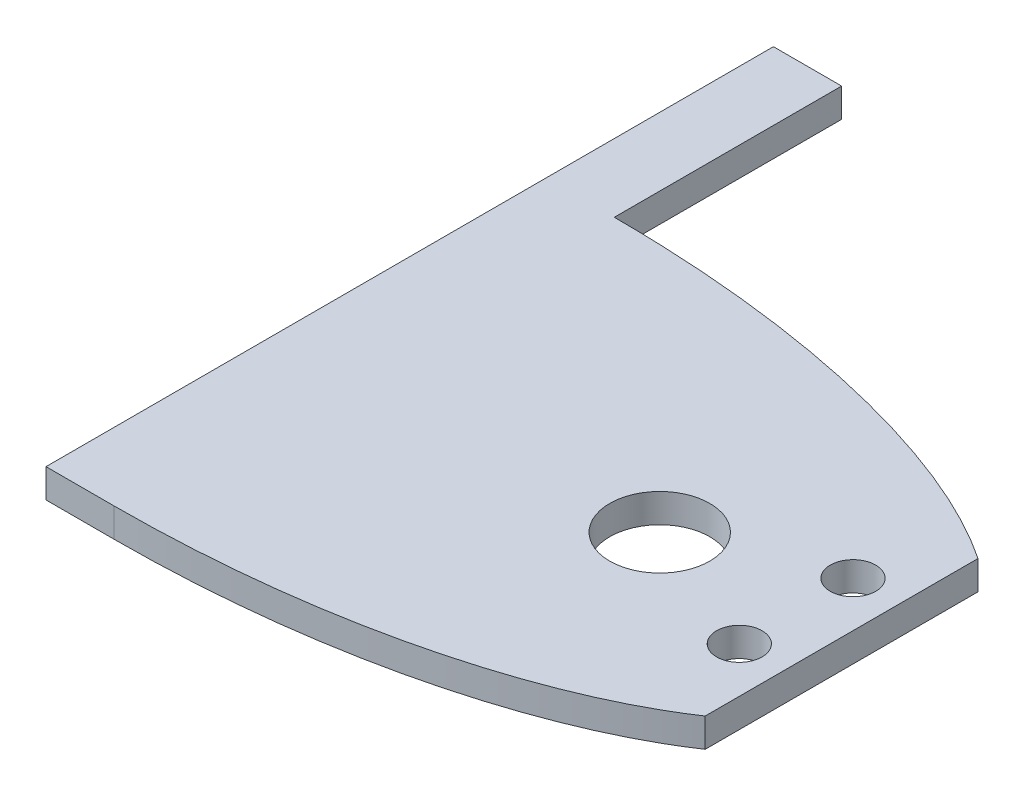
ISO-10303-21;
HEADER;
FILE_DESCRIPTION(('STEP AP214'),'2;1');
FILE_NAME('part.step','',(''),(''),'','','');
FILE_SCHEMA(('AUTOMOTIVE_DESIGN { 1 0 10303 214 1 1 1 1 }'));
ENDSEC;
DATA;
#1=APPLICATION_CONTEXT('core data for automotive mechanical design processes');
#2=APPLICATION_PROTOCOL_DEFINITION('international standard','automotive_design',2000,#1);
#3=PRODUCT_CONTEXT('',#1,'mechanical');
#4=PRODUCT('Part','Part','',(#3));
#5=PRODUCT_RELATED_PRODUCT_CATEGORY('part','',(#4));
#6=PRODUCT_DEFINITION_FORMATION('','',#4);
#7=PRODUCT_DEFINITION_CONTEXT('part definition',#1,'design');
#8=PRODUCT_DEFINITION('design','',#6,#7);
#9=PRODUCT_DEFINITION_SHAPE('','',#8);
#10=(LENGTH_UNIT() NAMED_UNIT(*) SI_UNIT(.MILLI.,.METRE.));
#11=(NAMED_UNIT(*) PLANE_ANGLE_UNIT() SI_UNIT($,.RADIAN.));
#12=(NAMED_UNIT(*) SI_UNIT($,.STERADIAN.) SOLID_ANGLE_UNIT());
#13=UNCERTAINTY_MEASURE_WITH_UNIT(LENGTH_MEASURE(1.E-05),#10,'distance_accuracy_value','');
#14=(GEOMETRIC_REPRESENTATION_CONTEXT(3) GLOBAL_UNCERTAINTY_ASSIGNED_CONTEXT((#13)) GLOBAL_UNIT_ASSIGNED_CONTEXT((#10,
#11,#12)) REPRESENTATION_CONTEXT('',''));
#15=CARTESIAN_POINT('',(0.,0.,0.));
#16=DIRECTION('',(0.,0.,1.));
#17=DIRECTION('',(1.,0.,0.));
#18=AXIS2_PLACEMENT_3D('',#15,#16,#17);
#19=CARTESIAN_POINT('',(0.,6.35,-54.9999999999999));
#20=DIRECTION('',(0.,1.,0.));
#21=DIRECTION('',(-1.,0.,0.));
#22=AXIS2_PLACEMENT_3D('',#19,#20,#21);
#23=ELLIPSE('',#22,125.277339390274,54.9999999999999);
#24=DIRECTION('',(0.,-1.,0.));
#25=VECTOR('',#24,1.);
#26=SURFACE_OF_LINEAR_EXTRUSION('',#23,#25);
#27=CARTESIAN_POINT('',(0.,0.,-54.9999999999999));
#28=DIRECTION('',(0.,1.,0.));
#29=DIRECTION('',(-1.,0.,0.));
#30=AXIS2_PLACEMENT_3D('',#27,#28,#29);
#31=ELLIPSE('',#30,125.277339390274,54.9999999999999);
#32=CARTESIAN_POINT('',(105.,0.,-85.0000000000002));
#33=VERTEX_POINT('',#32);
#34=CARTESIAN_POINT('',(0.,0.,-110.));
#35=VERTEX_POINT('',#34);
#36=EDGE_CURVE('E126',#33,#35,#31,.T.);
#37=ORIENTED_EDGE('',*,*,#36,.T.);
#38=DIRECTION('',(0.,-1.,0.));
#39=VECTOR('',#38,1.);
#40=CARTESIAN_POINT('',(0.,6.35,-110.));
#41=LINE('',#40,#39);
#42=CARTESIAN_POINT('',(0.,6.35,-110.));
#43=VERTEX_POINT('',#42);
#44=EDGE_CURVE('E11',#43,#35,#41,.T.);
#45=ORIENTED_EDGE('',*,*,#44,.F.);
#46=CARTESIAN_POINT('',(105.,6.35,-85.0000000000002));
#47=VERTEX_POINT('',#46);
#48=EDGE_CURVE('E121',#47,#43,#23,.T.);
#49=ORIENTED_EDGE('',*,*,#48,.F.);
#50=DIRECTION('',(0.,-1.,0.));
#51=VECTOR('',#50,1.);
#52=CARTESIAN_POINT('',(105.,6.35,-85.0000000000002));
#53=LINE('',#52,#51);
#54=EDGE_CURVE('E127',#47,#33,#53,.T.);
#55=ORIENTED_EDGE('',*,*,#54,.T.);
#56=EDGE_LOOP('',(#37,#45,#49,#55));
#57=FACE_BOUND('',#56,.T.);
#58=ADVANCED_FACE('F41',(#57),#26,.F.);
#59=CARTESIAN_POINT('',(0.,6.35,-54.9999999999999));
#60=DIRECTION('',(0.,1.,0.));
#61=DIRECTION('',(-1.,0.,0.));
#62=AXIS2_PLACEMENT_3D('',#59,#60,#61);
#63=ELLIPSE('',#62,125.277339390274,55.0000000000002);
#64=DIRECTION('',(0.,-1.,0.));
#65=VECTOR('',#64,1.);
#66=SURFACE_OF_LINEAR_EXTRUSION('',#63,#65);
#67=CARTESIAN_POINT('',(0.,0.,-54.9999999999999));
#68=DIRECTION('',(0.,1.,0.));
#69=DIRECTION('',(-1.,0.,0.));
#70=AXIS2_PLACEMENT_3D('',#67,#68,#69);
#71=ELLIPSE('',#70,125.277339390274,55.0000000000002);
#72=CARTESIAN_POINT('',(0.,0.,0.));
#73=VERTEX_POINT('',#72);
#74=CARTESIAN_POINT('',(105.,0.,-24.9999999999999));
#75=VERTEX_POINT('',#74);
#76=EDGE_CURVE('E73',#73,#75,#71,.T.);
#77=ORIENTED_EDGE('',*,*,#76,.T.);
#78=DIRECTION('',(0.,-1.,0.));
#79=VECTOR('',#78,1.);
#80=CARTESIAN_POINT('',(105.,6.35,-24.9999999999999));
#81=LINE('',#80,#79);
#82=CARTESIAN_POINT('',(105.,6.35,-24.9999999999999));
#83=VERTEX_POINT('',#82);
#84=EDGE_CURVE('E145',#83,#75,#81,.T.);
#85=ORIENTED_EDGE('',*,*,#84,.F.);
#86=CARTESIAN_POINT('',(0.,6.35,0.));
#87=VERTEX_POINT('',#86);
#88=EDGE_CURVE('E81',#87,#83,#63,.T.);
#89=ORIENTED_EDGE('',*,*,#88,.F.);
#90=DIRECTION('',(0.,-1.,0.));
#91=VECTOR('',#90,1.);
#92=CARTESIAN_POINT('',(0.,6.35,0.));
#93=LINE('',#92,#91);
#94=EDGE_CURVE('E51',#87,#73,#93,.T.);
#95=ORIENTED_EDGE('',*,*,#94,.T.);
#96=EDGE_LOOP('',(#77,#85,#89,#95));
#97=FACE_BOUND('',#96,.T.);
#98=ADVANCED_FACE('F149',(#97),#66,.F.);
#99=CARTESIAN_POINT('',(105.,6.35,-85.0000000000002));
#100=DIRECTION('',(-1.,0.,0.));
#101=DIRECTION('',(0.,0.,1.));
#102=AXIS2_PLACEMENT_3D('',#99,#100,#101);
#103=PLANE('',#102);
#104=DIRECTION('',(0.,0.,-1.));
#105=VECTOR('',#104,1.);
#106=CARTESIAN_POINT('',(105.,0.,-85.0000000000002));
#107=LINE('',#106,#105);
#108=EDGE_CURVE('E78',#75,#33,#107,.T.);
#109=ORIENTED_EDGE('',*,*,#108,.T.);
#110=ORIENTED_EDGE('',*,*,#54,.F.);
#111=DIRECTION('',(0.,0.,-1.));
#112=VECTOR('',#111,1.);
#113=CARTESIAN_POINT('',(105.,6.35,-85.0000000000002));
#114=LINE('',#113,#112);
#115=EDGE_CURVE('E59',#83,#47,#114,.T.);
#116=ORIENTED_EDGE('',*,*,#115,.F.);
#117=ORIENTED_EDGE('',*,*,#84,.T.);
#118=EDGE_LOOP('',(#109,#110,#116,#117));
#119=FACE_BOUND('',#118,.T.);
#120=ADVANCED_FACE('F196',(#119),#103,.F.);
#121=CARTESIAN_POINT('',(0.,6.35,-54.9999999999999));
#122=DIRECTION('',(0.,1.,0.));
#123=DIRECTION('',(0.,0.,1.));
#124=AXIS2_PLACEMENT_3D('',#121,#122,#123);
#125=PLANE('',#124);
#126=CARTESIAN_POINT('',(65.,6.35,-55.0000000000002));
#127=DIRECTION('',(0.,1.,0.));
#128=DIRECTION('',(0.,0.,1.));
#129=AXIS2_PLACEMENT_3D('',#126,#127,#128);
#130=CIRCLE('',#129,11.);
#131=CARTESIAN_POINT('',(65.,6.35,-44.0000000000002));
#132=VERTEX_POINT('',#131);
#133=EDGE_CURVE('E174',#132,#132,#130,.T.);
#134=ORIENTED_EDGE('',*,*,#133,.F.);
#135=EDGE_LOOP('',(#134));
#136=FACE_BOUND('',#135,.T.);
#137=CARTESIAN_POINT('',(95.0000000000001,6.35,-67.4999999999999));
#138=DIRECTION('',(0.,1.,0.));
#139=DIRECTION('',(0.,0.,1.));
#140=AXIS2_PLACEMENT_3D('',#137,#138,#139);
#141=CIRCLE('',#140,5.00000000000001);
#142=CARTESIAN_POINT('',(95.0000000000001,6.35,-62.4999999999999));
#143=VERTEX_POINT('',#142);
#144=EDGE_CURVE('E130',#143,#143,#141,.T.);
#145=ORIENTED_EDGE('',*,*,#144,.F.);
#146=EDGE_LOOP('',(#145));
#147=FACE_BOUND('',#146,.T.);
#148=CARTESIAN_POINT('',(95.0000000000001,6.35,-42.4999999999999));
#149=DIRECTION('',(0.,1.,0.));
#150=DIRECTION('',(0.,0.,1.));
#151=AXIS2_PLACEMENT_3D('',#148,#149,#150);
#152=CIRCLE('',#151,5.00000000000001);
#153=CARTESIAN_POINT('',(95.0000000000001,6.35,-37.4999999999999));
#154=VERTEX_POINT('',#153);
#155=EDGE_CURVE('E185',#154,#154,#152,.T.);
#156=ORIENTED_EDGE('',*,*,#155,.F.);
#157=EDGE_LOOP('',(#156));
#158=FACE_BOUND('',#157,.T.);
#159=ORIENTED_EDGE('',*,*,#48,.T.);
#160=DIRECTION('',(0.,0.,-1.));
#161=VECTOR('',#160,1.);
#162=CARTESIAN_POINT('',(0.,6.35,-160.));
#163=LINE('',#162,#161);
#164=CARTESIAN_POINT('',(0.,6.35,-160.));
#165=VERTEX_POINT('',#164);
#166=EDGE_CURVE('E108',#43,#165,#163,.T.);
#167=ORIENTED_EDGE('',*,*,#166,.T.);
#168=DIRECTION('',(-1.,0.,0.));
#169=VECTOR('',#168,1.);
#170=CARTESIAN_POINT('',(-15.0000000000013,6.35,-160.));
#171=LINE('',#170,#169);
#172=CARTESIAN_POINT('',(-15.0000000000013,6.35,-160.));
#173=VERTEX_POINT('',#172);
#174=EDGE_CURVE('E117',#165,#173,#171,.T.);
#175=ORIENTED_EDGE('',*,*,#174,.T.);
#176=DIRECTION('',(0.,0.,1.));
#177=VECTOR('',#176,1.);
#178=CARTESIAN_POINT('',(-15.0000000000013,6.35,-110.));
#179=LINE('',#178,#177);
#180=CARTESIAN_POINT('',(-15.0000000000013,6.35,0.));
#181=VERTEX_POINT('',#180);
#182=EDGE_CURVE('E161',#173,#181,#179,.T.);
#183=ORIENTED_EDGE('',*,*,#182,.T.);
#184=DIRECTION('',(1.,0.,0.));
#185=VECTOR('',#184,1.);
#186=CARTESIAN_POINT('',(-15.0000000000013,6.35,0.));
#187=LINE('',#186,#185);
#188=EDGE_CURVE('E166',#181,#87,#187,.T.);
#189=ORIENTED_EDGE('',*,*,#188,.T.);
#190=ORIENTED_EDGE('',*,*,#88,.T.);
#191=ORIENTED_EDGE('',*,*,#115,.T.);
#192=EDGE_LOOP('',(#159,#167,#175,#183,#189,#190,#191));
#193=FACE_BOUND('',#192,.T.);
#194=ADVANCED_FACE('F122',(#136,#147,#158,#193),#125,.T.);
#195=CARTESIAN_POINT('',(0.,0.,-54.9999999999999));
#196=DIRECTION('',(0.,1.,0.));
#197=DIRECTION('',(0.,0.,1.));
#198=AXIS2_PLACEMENT_3D('',#195,#196,#197);
#199=PLANE('',#198);
#200=CARTESIAN_POINT('',(65.,0.,-55.0000000000002));
#201=DIRECTION('',(0.,1.,0.));
#202=DIRECTION('',(0.,0.,1.));
#203=AXIS2_PLACEMENT_3D('',#200,#201,#202);
#204=CIRCLE('',#203,11.);
#205=CARTESIAN_POINT('',(65.,0.,-44.0000000000002));
#206=VERTEX_POINT('',#205);
#207=EDGE_CURVE('E173',#206,#206,#204,.T.);
#208=ORIENTED_EDGE('',*,*,#207,.T.);
#209=EDGE_LOOP('',(#208));
#210=FACE_BOUND('',#209,.T.);
#211=CARTESIAN_POINT('',(95.0000000000001,0.,-67.4999999999999));
#212=DIRECTION('',(0.,1.,0.));
#213=DIRECTION('',(0.,0.,1.));
#214=AXIS2_PLACEMENT_3D('',#211,#212,#213);
#215=CIRCLE('',#214,5.00000000000001);
#216=CARTESIAN_POINT('',(95.0000000000001,0.,-62.4999999999999));
#217=VERTEX_POINT('',#216);
#218=EDGE_CURVE('E136',#217,#217,#215,.T.);
#219=ORIENTED_EDGE('',*,*,#218,.T.);
#220=EDGE_LOOP('',(#219));
#221=FACE_BOUND('',#220,.T.);
#222=CARTESIAN_POINT('',(95.0000000000001,0.,-42.4999999999999));
#223=DIRECTION('',(0.,1.,0.));
#224=DIRECTION('',(0.,0.,1.));
#225=AXIS2_PLACEMENT_3D('',#222,#223,#224);
#226=CIRCLE('',#225,5.00000000000001);
#227=CARTESIAN_POINT('',(95.0000000000001,0.,-37.4999999999999));
#228=VERTEX_POINT('',#227);
#229=EDGE_CURVE('E178',#228,#228,#226,.T.);
#230=ORIENTED_EDGE('',*,*,#229,.T.);
#231=EDGE_LOOP('',(#230));
#232=FACE_BOUND('',#231,.T.);
#233=ORIENTED_EDGE('',*,*,#36,.F.);
#234=ORIENTED_EDGE('',*,*,#108,.F.);
#235=ORIENTED_EDGE('',*,*,#76,.F.);
#236=DIRECTION('',(1.,0.,0.));
#237=VECTOR('',#236,1.);
#238=CARTESIAN_POINT('',(-15.0000000000013,0.,0.));
#239=LINE('',#238,#237);
#240=CARTESIAN_POINT('',(-15.0000000000013,0.,0.));
#241=VERTEX_POINT('',#240);
#242=EDGE_CURVE('E155',#241,#73,#239,.T.);
#243=ORIENTED_EDGE('',*,*,#242,.F.);
#244=DIRECTION('',(0.,0.,1.));
#245=VECTOR('',#244,1.);
#246=CARTESIAN_POINT('',(-15.0000000000013,0.,-110.));
#247=LINE('',#246,#245);
#248=CARTESIAN_POINT('',(-15.0000000000013,0.,-160.));
#249=VERTEX_POINT('',#248);
#250=EDGE_CURVE('E162',#249,#241,#247,.T.);
#251=ORIENTED_EDGE('',*,*,#250,.F.);
#252=DIRECTION('',(-1.,0.,0.));
#253=VECTOR('',#252,1.);
#254=CARTESIAN_POINT('',(-15.0000000000013,0.,-160.));
#255=LINE('',#254,#253);
#256=CARTESIAN_POINT('',(0.,0.,-160.));
#257=VERTEX_POINT('',#256);
#258=EDGE_CURVE('E118',#257,#249,#255,.T.);
#259=ORIENTED_EDGE('',*,*,#258,.F.);
#260=DIRECTION('',(0.,0.,-1.));
#261=VECTOR('',#260,1.);
#262=CARTESIAN_POINT('',(0.,0.,-160.));
#263=LINE('',#262,#261);
#264=EDGE_CURVE('E322',#35,#257,#263,.T.);
#265=ORIENTED_EDGE('',*,*,#264,.F.);
#266=EDGE_LOOP('',(#233,#234,#235,#243,#251,#259,#265));
#267=FACE_BOUND('',#266,.T.);
#268=ADVANCED_FACE('F154',(#210,#221,#232,#267),#199,.F.);
#269=CARTESIAN_POINT('',(95.0000000000001,6.35,-42.4999999999999));
#270=DIRECTION('',(0.,-1.,0.));
#271=DIRECTION('',(0.,0.,-1.));
#272=AXIS2_PLACEMENT_3D('',#269,#270,#271);
#273=CYLINDRICAL_SURFACE('',#272,5.00000000000001);
#274=ORIENTED_EDGE('',*,*,#155,.T.);
#275=EDGE_LOOP('',(#274));
#276=FACE_BOUND('',#275,.T.);
#277=ORIENTED_EDGE('',*,*,#229,.F.);
#278=EDGE_LOOP('',(#277));
#279=FACE_BOUND('',#278,.T.);
#280=ADVANCED_FACE('F201',(#276,#279),#273,.F.);
#281=CARTESIAN_POINT('',(95.0000000000001,6.35,-67.4999999999999));
#282=DIRECTION('',(0.,-1.,0.));
#283=DIRECTION('',(0.,0.,-1.));
#284=AXIS2_PLACEMENT_3D('',#281,#282,#283);
#285=CYLINDRICAL_SURFACE('',#284,5.00000000000001);
#286=ORIENTED_EDGE('',*,*,#144,.T.);
#287=EDGE_LOOP('',(#286));
#288=FACE_BOUND('',#287,.T.);
#289=ORIENTED_EDGE('',*,*,#218,.F.);
#290=EDGE_LOOP('',(#289));
#291=FACE_BOUND('',#290,.T.);
#292=ADVANCED_FACE('F208',(#288,#291),#285,.F.);
#293=CARTESIAN_POINT('',(65.,6.35,-55.0000000000002));
#294=DIRECTION('',(0.,-1.,0.));
#295=DIRECTION('',(0.,0.,-1.));
#296=AXIS2_PLACEMENT_3D('',#293,#294,#295);
#297=CYLINDRICAL_SURFACE('',#296,11.);
#298=ORIENTED_EDGE('',*,*,#133,.T.);
#299=EDGE_LOOP('',(#298));
#300=FACE_BOUND('',#299,.T.);
#301=ORIENTED_EDGE('',*,*,#207,.F.);
#302=EDGE_LOOP('',(#301));
#303=FACE_BOUND('',#302,.T.);
#304=ADVANCED_FACE('F212',(#300,#303),#297,.F.);
#305=CARTESIAN_POINT('',(-15.0000000000013,6.35,-110.));
#306=DIRECTION('',(1.,0.,0.));
#307=DIRECTION('',(0.,0.,-1.));
#308=AXIS2_PLACEMENT_3D('',#305,#306,#307);
#309=PLANE('',#308);
#310=ORIENTED_EDGE('',*,*,#250,.T.);
#311=DIRECTION('',(0.,-1.,0.));
#312=VECTOR('',#311,1.);
#313=CARTESIAN_POINT('',(-15.0000000000013,6.35,0.));
#314=LINE('',#313,#312);
#315=EDGE_CURVE('E159',#181,#241,#314,.T.);
#316=ORIENTED_EDGE('',*,*,#315,.F.);
#317=ORIENTED_EDGE('',*,*,#182,.F.);
#318=DIRECTION('',(0.,-1.,0.));
#319=VECTOR('',#318,1.);
#320=CARTESIAN_POINT('',(-15.0000000000013,6.35,-160.));
#321=LINE('',#320,#319);
#322=EDGE_CURVE('E320',#173,#249,#321,.T.);
#323=ORIENTED_EDGE('',*,*,#322,.T.);
#324=EDGE_LOOP('',(#310,#316,#317,#323));
#325=FACE_BOUND('',#324,.T.);
#326=ADVANCED_FACE('F216',(#325),#309,.F.);
#327=CARTESIAN_POINT('',(-15.0000000000013,6.35,0.));
#328=DIRECTION('',(0.,0.,-1.));
#329=DIRECTION('',(-1.,0.,0.));
#330=AXIS2_PLACEMENT_3D('',#327,#328,#329);
#331=PLANE('',#330);
#332=ORIENTED_EDGE('',*,*,#242,.T.);
#333=ORIENTED_EDGE('',*,*,#94,.F.);
#334=ORIENTED_EDGE('',*,*,#188,.F.);
#335=ORIENTED_EDGE('',*,*,#315,.T.);
#336=EDGE_LOOP('',(#332,#333,#334,#335));
#337=FACE_BOUND('',#336,.T.);
#338=ADVANCED_FACE('F157',(#337),#331,.F.);
#339=CARTESIAN_POINT('',(0.,6.35,-160.));
#340=DIRECTION('',(-1.,0.,0.));
#341=DIRECTION('',(0.,0.,1.));
#342=AXIS2_PLACEMENT_3D('',#339,#340,#341);
#343=PLANE('',#342);
#344=ORIENTED_EDGE('',*,*,#264,.T.);
#345=DIRECTION('',(0.,-1.,0.));
#346=VECTOR('',#345,1.);
#347=CARTESIAN_POINT('',(0.,6.35,-160.));
#348=LINE('',#347,#346);
#349=EDGE_CURVE('E113',#165,#257,#348,.T.);
#350=ORIENTED_EDGE('',*,*,#349,.F.);
#351=ORIENTED_EDGE('',*,*,#166,.F.);
#352=ORIENTED_EDGE('',*,*,#44,.T.);
#353=EDGE_LOOP('',(#344,#350,#351,#352));
#354=FACE_BOUND('',#353,.T.);
#355=ADVANCED_FACE('F109',(#354),#343,.F.);
#356=CARTESIAN_POINT('',(-15.0000000000013,6.35,-160.));
#357=DIRECTION('',(0.,0.,1.));
#358=DIRECTION('',(1.,0.,0.));
#359=AXIS2_PLACEMENT_3D('',#356,#357,#358);
#360=PLANE('',#359);
#361=ORIENTED_EDGE('',*,*,#258,.T.);
#362=ORIENTED_EDGE('',*,*,#322,.F.);
#363=ORIENTED_EDGE('',*,*,#174,.F.);
#364=ORIENTED_EDGE('',*,*,#349,.T.);
#365=EDGE_LOOP('',(#361,#362,#363,#364));
#366=FACE_BOUND('',#365,.T.);
#367=ADVANCED_FACE('F225',(#366),#360,.F.);
#368=CLOSED_SHELL('',(#58,#98,#120,#194,#268,#280,#292,#304,#326,#338,#355,#367));
#369=MANIFOLD_SOLID_BREP('B2',#368);
#370=ADVANCED_BREP_SHAPE_REPRESENTATION('',(#18,#369),#14);
#371=SHAPE_DEFINITION_REPRESENTATION(#9,#370);
ENDSEC;
END-ISO-10303-21;
